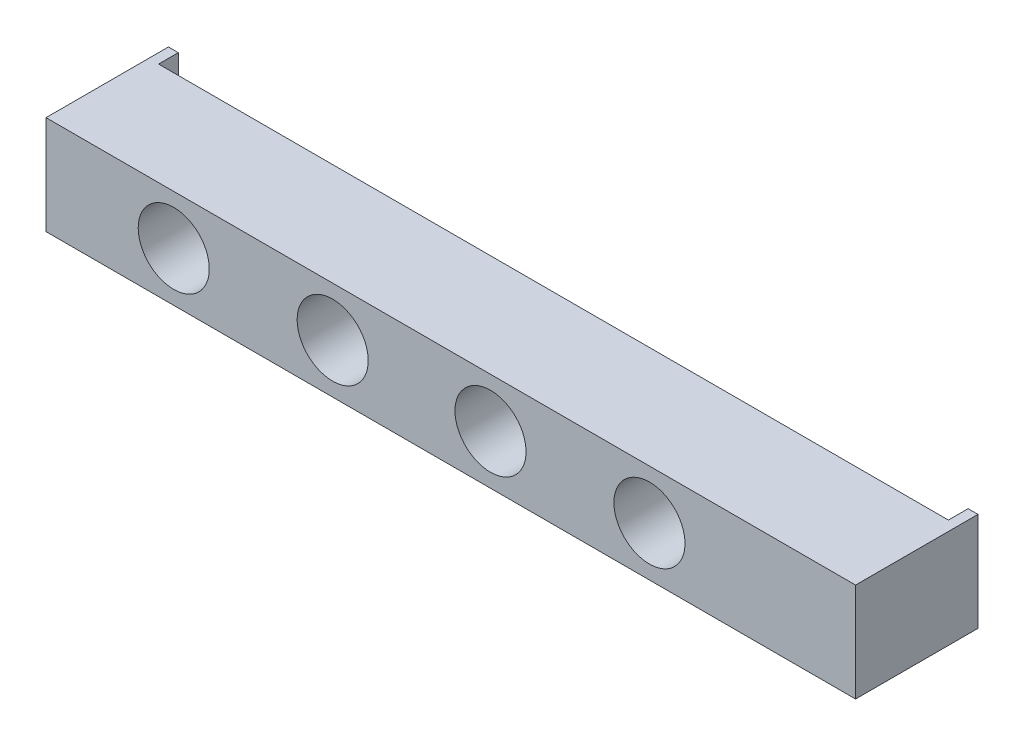
ISO-10303-21;
HEADER;
FILE_DESCRIPTION(('STEP AP214'),'2;1');
FILE_NAME('part.step','',(''),(''),'','','');
FILE_SCHEMA(('AUTOMOTIVE_DESIGN { 1 0 10303 214 1 1 1 1 }'));
ENDSEC;
DATA;
#1=APPLICATION_CONTEXT('core data for automotive mechanical design processes');
#2=APPLICATION_PROTOCOL_DEFINITION('international standard','automotive_design',2000,#1);
#3=PRODUCT_CONTEXT('',#1,'mechanical');
#4=PRODUCT('Part','Part','',(#3));
#5=PRODUCT_RELATED_PRODUCT_CATEGORY('part','',(#4));
#6=PRODUCT_DEFINITION_FORMATION('','',#4);
#7=PRODUCT_DEFINITION_CONTEXT('part definition',#1,'design');
#8=PRODUCT_DEFINITION('design','',#6,#7);
#9=PRODUCT_DEFINITION_SHAPE('','',#8);
#10=(LENGTH_UNIT() NAMED_UNIT(*) SI_UNIT(.MILLI.,.METRE.));
#11=(NAMED_UNIT(*) PLANE_ANGLE_UNIT() SI_UNIT($,.RADIAN.));
#12=(NAMED_UNIT(*) SI_UNIT($,.STERADIAN.) SOLID_ANGLE_UNIT());
#13=UNCERTAINTY_MEASURE_WITH_UNIT(LENGTH_MEASURE(1.E-05),#10,'distance_accuracy_value','');
#14=(GEOMETRIC_REPRESENTATION_CONTEXT(3) GLOBAL_UNCERTAINTY_ASSIGNED_CONTEXT((#13)) GLOBAL_UNIT_ASSIGNED_CONTEXT((#10,
#11,#12)) REPRESENTATION_CONTEXT('',''));
#15=CARTESIAN_POINT('',(0.,0.,0.));
#16=DIRECTION('',(0.,0.,1.));
#17=DIRECTION('',(1.,0.,0.));
#18=AXIS2_PLACEMENT_3D('',#15,#16,#17);
#19=CARTESIAN_POINT('',(0.,0.,0.));
#20=DIRECTION('',(0.,0.,-1.));
#21=DIRECTION('',(-1.,0.,0.));
#22=AXIS2_PLACEMENT_3D('',#19,#20,#21);
#23=PLANE('',#22);
#24=CARTESIAN_POINT('',(32.3443244123659,12.5,0.));
#25=DIRECTION('',(0.,0.,-1.));
#26=DIRECTION('',(-1.,0.,0.));
#27=AXIS2_PLACEMENT_3D('',#24,#25,#26);
#28=CIRCLE('',#27,8.99999999999999);
#29=CARTESIAN_POINT('',(23.3443244123659,12.5,0.));
#30=VERTEX_POINT('',#29);
#31=EDGE_CURVE('E341',#30,#30,#28,.T.);
#32=ORIENTED_EDGE('',*,*,#31,.F.);
#33=EDGE_LOOP('',(#32));
#34=FACE_BOUND('',#33,.T.);
#35=CARTESIAN_POINT('',(72.5886654471327,12.5,0.));
#36=DIRECTION('',(0.,0.,-1.));
#37=DIRECTION('',(-1.,0.,0.));
#38=AXIS2_PLACEMENT_3D('',#35,#36,#37);
#39=CIRCLE('',#38,8.99999999999999);
#40=CARTESIAN_POINT('',(63.5886654471327,12.5,0.));
#41=VERTEX_POINT('',#40);
#42=EDGE_CURVE('E343',#41,#41,#39,.T.);
#43=ORIENTED_EDGE('',*,*,#42,.F.);
#44=EDGE_LOOP('',(#43));
#45=FACE_BOUND('',#44,.T.);
#46=CARTESIAN_POINT('',(112.561085258692,12.5,0.));
#47=DIRECTION('',(0.,0.,-1.));
#48=DIRECTION('',(-1.,0.,0.));
#49=AXIS2_PLACEMENT_3D('',#46,#47,#48);
#50=CIRCLE('',#49,8.99999999999999);
#51=CARTESIAN_POINT('',(103.561085258692,12.5,0.));
#52=VERTEX_POINT('',#51);
#53=EDGE_CURVE('E351',#52,#52,#50,.T.);
#54=ORIENTED_EDGE('',*,*,#53,.F.);
#55=EDGE_LOOP('',(#54));
#56=FACE_BOUND('',#55,.T.);
#57=CARTESIAN_POINT('',(152.805426293458,12.5,0.));
#58=DIRECTION('',(0.,0.,-1.));
#59=DIRECTION('',(-1.,0.,0.));
#60=AXIS2_PLACEMENT_3D('',#57,#58,#59);
#61=CIRCLE('',#60,8.99999999999998);
#62=CARTESIAN_POINT('',(143.805426293458,12.5,0.));
#63=VERTEX_POINT('',#62);
#64=EDGE_CURVE('E356',#63,#63,#61,.T.);
#65=ORIENTED_EDGE('',*,*,#64,.F.);
#66=EDGE_LOOP('',(#65));
#67=FACE_BOUND('',#66,.T.);
#68=DIRECTION('',(-1.,0.,0.));
#69=VECTOR('',#68,1.);
#70=CARTESIAN_POINT('',(0.,25.,0.));
#71=LINE('',#70,#69);
#72=CARTESIAN_POINT('',(202.5,25.,0.));
#73=VERTEX_POINT('',#72);
#74=CARTESIAN_POINT('',(2.5,25.,0.));
#75=VERTEX_POINT('',#74);
#76=EDGE_CURVE('E66',#73,#75,#71,.T.);
#77=ORIENTED_EDGE('',*,*,#76,.F.);
#78=DIRECTION('',(0.,1.,0.));
#79=VECTOR('',#78,1.);
#80=CARTESIAN_POINT('',(202.5,25.,0.));
#81=LINE('',#80,#79);
#82=CARTESIAN_POINT('',(202.5,0.,0.));
#83=VERTEX_POINT('',#82);
#84=EDGE_CURVE('E132',#83,#73,#81,.T.);
#85=ORIENTED_EDGE('',*,*,#84,.F.);
#86=DIRECTION('',(1.,0.,0.));
#87=VECTOR('',#86,1.);
#88=CARTESIAN_POINT('',(0.,0.,0.));
#89=LINE('',#88,#87);
#90=CARTESIAN_POINT('',(2.5,0.,0.));
#91=VERTEX_POINT('',#90);
#92=EDGE_CURVE('E162',#91,#83,#89,.T.);
#93=ORIENTED_EDGE('',*,*,#92,.F.);
#94=DIRECTION('',(0.,-1.,0.));
#95=VECTOR('',#94,1.);
#96=CARTESIAN_POINT('',(2.5,25.,0.));
#97=LINE('',#96,#95);
#98=EDGE_CURVE('E143',#75,#91,#97,.T.);
#99=ORIENTED_EDGE('',*,*,#98,.F.);
#100=EDGE_LOOP('',(#77,#85,#93,#99));
#101=FACE_BOUND('',#100,.T.);
#102=ADVANCED_FACE('F46',(#34,#45,#56,#67,#101),#23,.T.);
#103=CARTESIAN_POINT('',(0.,0.,26.));
#104=DIRECTION('',(1.,0.,0.));
#105=DIRECTION('',(0.,0.,-1.));
#106=AXIS2_PLACEMENT_3D('',#103,#104,#105);
#107=PLANE('',#106);
#108=DIRECTION('',(0.,0.,-1.));
#109=VECTOR('',#108,1.);
#110=CARTESIAN_POINT('',(0.,25.,26.));
#111=LINE('',#110,#109);
#112=CARTESIAN_POINT('',(0.,25.,26.));
#113=VERTEX_POINT('',#112);
#114=CARTESIAN_POINT('',(0.,25.,-5.));
#115=VERTEX_POINT('',#114);
#116=EDGE_CURVE('E171',#113,#115,#111,.T.);
#117=ORIENTED_EDGE('',*,*,#116,.T.);
#118=DIRECTION('',(0.,1.,0.));
#119=VECTOR('',#118,1.);
#120=CARTESIAN_POINT('',(0.,25.,-5.));
#121=LINE('',#120,#119);
#122=CARTESIAN_POINT('',(0.,0.,-5.));
#123=VERTEX_POINT('',#122);
#124=EDGE_CURVE('E144',#123,#115,#121,.T.);
#125=ORIENTED_EDGE('',*,*,#124,.F.);
#126=DIRECTION('',(0.,0.,-1.));
#127=VECTOR('',#126,1.);
#128=CARTESIAN_POINT('',(0.,0.,26.));
#129=LINE('',#128,#127);
#130=CARTESIAN_POINT('',(0.,0.,26.));
#131=VERTEX_POINT('',#130);
#132=EDGE_CURVE('E13',#131,#123,#129,.T.);
#133=ORIENTED_EDGE('',*,*,#132,.F.);
#134=DIRECTION('',(0.,-1.,0.));
#135=VECTOR('',#134,1.);
#136=CARTESIAN_POINT('',(0.,0.,26.));
#137=LINE('',#136,#135);
#138=EDGE_CURVE('E163',#113,#131,#137,.T.);
#139=ORIENTED_EDGE('',*,*,#138,.F.);
#140=EDGE_LOOP('',(#117,#125,#133,#139));
#141=FACE_BOUND('',#140,.T.);
#142=ADVANCED_FACE('F48',(#141),#107,.F.);
#143=CARTESIAN_POINT('',(0.,0.,26.));
#144=DIRECTION('',(0.,1.,0.));
#145=DIRECTION('',(0.,0.,1.));
#146=AXIS2_PLACEMENT_3D('',#143,#144,#145);
#147=PLANE('',#146);
#148=ORIENTED_EDGE('',*,*,#132,.T.);
#149=DIRECTION('',(-1.,0.,0.));
#150=VECTOR('',#149,1.);
#151=CARTESIAN_POINT('',(0.,0.,-5.));
#152=LINE('',#151,#150);
#153=CARTESIAN_POINT('',(2.5,0.,-5.));
#154=VERTEX_POINT('',#153);
#155=EDGE_CURVE('E151',#154,#123,#152,.T.);
#156=ORIENTED_EDGE('',*,*,#155,.F.);
#157=DIRECTION('',(0.,0.,1.));
#158=VECTOR('',#157,1.);
#159=CARTESIAN_POINT('',(2.5,0.,-5.));
#160=LINE('',#159,#158);
#161=EDGE_CURVE('E154',#154,#91,#160,.T.);
#162=ORIENTED_EDGE('',*,*,#161,.T.);
#163=ORIENTED_EDGE('',*,*,#92,.T.);
#164=DIRECTION('',(0.,0.,1.));
#165=VECTOR('',#164,1.);
#166=CARTESIAN_POINT('',(202.5,0.,-5.));
#167=LINE('',#166,#165);
#168=CARTESIAN_POINT('',(202.5,0.,-5.));
#169=VERTEX_POINT('',#168);
#170=EDGE_CURVE('E124',#169,#83,#167,.T.);
#171=ORIENTED_EDGE('',*,*,#170,.F.);
#172=DIRECTION('',(-1.,0.,0.));
#173=VECTOR('',#172,1.);
#174=CARTESIAN_POINT('',(205.,0.,-5.));
#175=LINE('',#174,#173);
#176=CARTESIAN_POINT('',(205.,0.,-5.));
#177=VERTEX_POINT('',#176);
#178=EDGE_CURVE('E121',#177,#169,#175,.T.);
#179=ORIENTED_EDGE('',*,*,#178,.F.);
#180=DIRECTION('',(0.,0.,-1.));
#181=VECTOR('',#180,1.);
#182=CARTESIAN_POINT('',(205.,0.,26.));
#183=LINE('',#182,#181);
#184=CARTESIAN_POINT('',(205.,0.,26.));
#185=VERTEX_POINT('',#184);
#186=EDGE_CURVE('E54',#185,#177,#183,.T.);
#187=ORIENTED_EDGE('',*,*,#186,.F.);
#188=DIRECTION('',(1.,0.,0.));
#189=VECTOR('',#188,1.);
#190=CARTESIAN_POINT('',(0.,0.,26.));
#191=LINE('',#190,#189);
#192=EDGE_CURVE('E166',#131,#185,#191,.T.);
#193=ORIENTED_EDGE('',*,*,#192,.F.);
#194=EDGE_LOOP('',(#148,#156,#162,#163,#171,#179,#187,#193));
#195=FACE_BOUND('',#194,.T.);
#196=ADVANCED_FACE('F122',(#195),#147,.F.);
#197=CARTESIAN_POINT('',(205.,0.,26.));
#198=DIRECTION('',(-1.,0.,0.));
#199=DIRECTION('',(0.,0.,1.));
#200=AXIS2_PLACEMENT_3D('',#197,#198,#199);
#201=PLANE('',#200);
#202=ORIENTED_EDGE('',*,*,#186,.T.);
#203=DIRECTION('',(0.,-1.,0.));
#204=VECTOR('',#203,1.);
#205=CARTESIAN_POINT('',(205.,25.,-5.));
#206=LINE('',#205,#204);
#207=CARTESIAN_POINT('',(205.,25.,-5.));
#208=VERTEX_POINT('',#207);
#209=EDGE_CURVE('E116',#208,#177,#206,.T.);
#210=ORIENTED_EDGE('',*,*,#209,.F.);
#211=DIRECTION('',(0.,0.,-1.));
#212=VECTOR('',#211,1.);
#213=CARTESIAN_POINT('',(205.,25.,26.));
#214=LINE('',#213,#212);
#215=CARTESIAN_POINT('',(205.,25.,26.));
#216=VERTEX_POINT('',#215);
#217=EDGE_CURVE('E119',#216,#208,#214,.T.);
#218=ORIENTED_EDGE('',*,*,#217,.F.);
#219=DIRECTION('',(0.,1.,0.));
#220=VECTOR('',#219,1.);
#221=CARTESIAN_POINT('',(205.,0.,26.));
#222=LINE('',#221,#220);
#223=EDGE_CURVE('E117',#185,#216,#222,.T.);
#224=ORIENTED_EDGE('',*,*,#223,.F.);
#225=EDGE_LOOP('',(#202,#210,#218,#224));
#226=FACE_BOUND('',#225,.T.);
#227=ADVANCED_FACE('F113',(#226),#201,.F.);
#228=CARTESIAN_POINT('',(0.,25.,26.));
#229=DIRECTION('',(0.,-1.,0.));
#230=DIRECTION('',(0.,0.,-1.));
#231=AXIS2_PLACEMENT_3D('',#228,#229,#230);
#232=PLANE('',#231);
#233=ORIENTED_EDGE('',*,*,#217,.T.);
#234=DIRECTION('',(1.,0.,0.));
#235=VECTOR('',#234,1.);
#236=CARTESIAN_POINT('',(205.,25.,-5.));
#237=LINE('',#236,#235);
#238=CARTESIAN_POINT('',(202.5,25.,-5.));
#239=VERTEX_POINT('',#238);
#240=EDGE_CURVE('E131',#239,#208,#237,.T.);
#241=ORIENTED_EDGE('',*,*,#240,.F.);
#242=DIRECTION('',(0.,0.,1.));
#243=VECTOR('',#242,1.);
#244=CARTESIAN_POINT('',(202.5,25.,-5.));
#245=LINE('',#244,#243);
#246=EDGE_CURVE('E61',#239,#73,#245,.T.);
#247=ORIENTED_EDGE('',*,*,#246,.T.);
#248=ORIENTED_EDGE('',*,*,#76,.T.);
#249=DIRECTION('',(0.,0.,1.));
#250=VECTOR('',#249,1.);
#251=CARTESIAN_POINT('',(2.5,25.,-5.));
#252=LINE('',#251,#250);
#253=CARTESIAN_POINT('',(2.5,25.,-5.));
#254=VERTEX_POINT('',#253);
#255=EDGE_CURVE('E159',#254,#75,#252,.T.);
#256=ORIENTED_EDGE('',*,*,#255,.F.);
#257=DIRECTION('',(1.,0.,0.));
#258=VECTOR('',#257,1.);
#259=CARTESIAN_POINT('',(0.,25.,-5.));
#260=LINE('',#259,#258);
#261=EDGE_CURVE('E147',#115,#254,#260,.T.);
#262=ORIENTED_EDGE('',*,*,#261,.F.);
#263=ORIENTED_EDGE('',*,*,#116,.F.);
#264=DIRECTION('',(-1.,0.,0.));
#265=VECTOR('',#264,1.);
#266=CARTESIAN_POINT('',(0.,25.,26.));
#267=LINE('',#266,#265);
#268=EDGE_CURVE('E169',#216,#113,#267,.T.);
#269=ORIENTED_EDGE('',*,*,#268,.F.);
#270=EDGE_LOOP('',(#233,#241,#247,#248,#256,#262,#263,#269));
#271=FACE_BOUND('',#270,.T.);
#272=ADVANCED_FACE('F176',(#271),#232,.F.);
#273=CARTESIAN_POINT('',(0.,0.,26.));
#274=DIRECTION('',(0.,0.,-1.));
#275=DIRECTION('',(-1.,0.,0.));
#276=AXIS2_PLACEMENT_3D('',#273,#274,#275);
#277=PLANE('',#276);
#278=CARTESIAN_POINT('',(32.3443244123659,12.5,26.));
#279=DIRECTION('',(0.,0.,-1.));
#280=DIRECTION('',(-1.,0.,0.));
#281=AXIS2_PLACEMENT_3D('',#278,#279,#280);
#282=CIRCLE('',#281,8.99999999999999);
#283=CARTESIAN_POINT('',(23.3443244123659,12.5,26.));
#284=VERTEX_POINT('',#283);
#285=EDGE_CURVE('E339',#284,#284,#282,.T.);
#286=ORIENTED_EDGE('',*,*,#285,.T.);
#287=EDGE_LOOP('',(#286));
#288=FACE_BOUND('',#287,.T.);
#289=CARTESIAN_POINT('',(72.5886654471327,12.5,26.));
#290=DIRECTION('',(0.,0.,-1.));
#291=DIRECTION('',(-1.,0.,0.));
#292=AXIS2_PLACEMENT_3D('',#289,#290,#291);
#293=CIRCLE('',#292,8.99999999999998);
#294=CARTESIAN_POINT('',(63.5886654471327,12.5,26.));
#295=VERTEX_POINT('',#294);
#296=EDGE_CURVE('E348',#295,#295,#293,.T.);
#297=ORIENTED_EDGE('',*,*,#296,.T.);
#298=EDGE_LOOP('',(#297));
#299=FACE_BOUND('',#298,.T.);
#300=CARTESIAN_POINT('',(112.561085258692,12.5,26.));
#301=DIRECTION('',(0.,0.,-1.));
#302=DIRECTION('',(-1.,0.,0.));
#303=AXIS2_PLACEMENT_3D('',#300,#301,#302);
#304=CIRCLE('',#303,8.99999999999998);
#305=CARTESIAN_POINT('',(103.561085258692,12.5,26.));
#306=VERTEX_POINT('',#305);
#307=EDGE_CURVE('E354',#306,#306,#304,.T.);
#308=ORIENTED_EDGE('',*,*,#307,.T.);
#309=EDGE_LOOP('',(#308));
#310=FACE_BOUND('',#309,.T.);
#311=CARTESIAN_POINT('',(152.805426293458,12.5,26.));
#312=DIRECTION('',(0.,0.,-1.));
#313=DIRECTION('',(-1.,0.,0.));
#314=AXIS2_PLACEMENT_3D('',#311,#312,#313);
#315=CIRCLE('',#314,8.99999999999998);
#316=CARTESIAN_POINT('',(143.805426293458,12.5,26.));
#317=VERTEX_POINT('',#316);
#318=EDGE_CURVE('E134',#317,#317,#315,.T.);
#319=ORIENTED_EDGE('',*,*,#318,.T.);
#320=EDGE_LOOP('',(#319));
#321=FACE_BOUND('',#320,.T.);
#322=ORIENTED_EDGE('',*,*,#138,.T.);
#323=ORIENTED_EDGE('',*,*,#192,.T.);
#324=ORIENTED_EDGE('',*,*,#223,.T.);
#325=ORIENTED_EDGE('',*,*,#268,.T.);
#326=EDGE_LOOP('',(#322,#323,#324,#325));
#327=FACE_BOUND('',#326,.T.);
#328=ADVANCED_FACE('F181',(#288,#299,#310,#321,#327),#277,.F.);
#329=CARTESIAN_POINT('',(2.5,25.,-5.));
#330=DIRECTION('',(-1.,0.,0.));
#331=DIRECTION('',(0.,-1.,0.));
#332=AXIS2_PLACEMENT_3D('',#329,#330,#331);
#333=PLANE('',#332);
#334=ORIENTED_EDGE('',*,*,#98,.T.);
#335=ORIENTED_EDGE('',*,*,#161,.F.);
#336=DIRECTION('',(0.,-1.,0.));
#337=VECTOR('',#336,1.);
#338=CARTESIAN_POINT('',(2.5,25.,-5.));
#339=LINE('',#338,#337);
#340=EDGE_CURVE('E149',#254,#154,#339,.T.);
#341=ORIENTED_EDGE('',*,*,#340,.F.);
#342=ORIENTED_EDGE('',*,*,#255,.T.);
#343=EDGE_LOOP('',(#334,#335,#341,#342));
#344=FACE_BOUND('',#343,.T.);
#345=ADVANCED_FACE('F191',(#344),#333,.F.);
#346=CARTESIAN_POINT('',(0.,0.,-5.));
#347=DIRECTION('',(0.,0.,1.));
#348=DIRECTION('',(1.,0.,0.));
#349=AXIS2_PLACEMENT_3D('',#346,#347,#348);
#350=PLANE('',#349);
#351=ORIENTED_EDGE('',*,*,#124,.T.);
#352=ORIENTED_EDGE('',*,*,#261,.T.);
#353=ORIENTED_EDGE('',*,*,#340,.T.);
#354=ORIENTED_EDGE('',*,*,#155,.T.);
#355=EDGE_LOOP('',(#351,#352,#353,#354));
#356=FACE_BOUND('',#355,.T.);
#357=ADVANCED_FACE('F187',(#356),#350,.F.);
#358=CARTESIAN_POINT('',(202.5,25.,-5.));
#359=DIRECTION('',(1.,0.,0.));
#360=DIRECTION('',(0.,0.,-1.));
#361=AXIS2_PLACEMENT_3D('',#358,#359,#360);
#362=PLANE('',#361);
#363=ORIENTED_EDGE('',*,*,#84,.T.);
#364=ORIENTED_EDGE('',*,*,#246,.F.);
#365=DIRECTION('',(0.,1.,0.));
#366=VECTOR('',#365,1.);
#367=CARTESIAN_POINT('',(202.5,25.,-5.));
#368=LINE('',#367,#366);
#369=EDGE_CURVE('E127',#169,#239,#368,.T.);
#370=ORIENTED_EDGE('',*,*,#369,.F.);
#371=ORIENTED_EDGE('',*,*,#170,.T.);
#372=EDGE_LOOP('',(#363,#364,#370,#371));
#373=FACE_BOUND('',#372,.T.);
#374=ADVANCED_FACE('F195',(#373),#362,.F.);
#375=CARTESIAN_POINT('',(0.,0.,-5.));
#376=DIRECTION('',(0.,0.,-1.));
#377=DIRECTION('',(-1.,0.,0.));
#378=AXIS2_PLACEMENT_3D('',#375,#376,#377);
#379=PLANE('',#378);
#380=ORIENTED_EDGE('',*,*,#209,.T.);
#381=ORIENTED_EDGE('',*,*,#178,.T.);
#382=ORIENTED_EDGE('',*,*,#369,.T.);
#383=ORIENTED_EDGE('',*,*,#240,.T.);
#384=EDGE_LOOP('',(#380,#381,#382,#383));
#385=FACE_BOUND('',#384,.T.);
#386=ADVANCED_FACE('F130',(#385),#379,.T.);
#387=CARTESIAN_POINT('',(152.805426293458,12.5,0.));
#388=DIRECTION('',(0.,0.,-1.));
#389=DIRECTION('',(-1.,0.,0.));
#390=AXIS2_PLACEMENT_3D('',#387,#388,#389);
#391=CYLINDRICAL_SURFACE('',#390,8.99999999999998);
#392=ORIENTED_EDGE('',*,*,#318,.F.);
#393=EDGE_LOOP('',(#392));
#394=FACE_BOUND('',#393,.T.);
#395=ORIENTED_EDGE('',*,*,#64,.T.);
#396=EDGE_LOOP('',(#395));
#397=FACE_BOUND('',#396,.T.);
#398=ADVANCED_FACE('F202',(#394,#397),#391,.F.);
#399=CARTESIAN_POINT('',(112.561085258692,12.5,0.));
#400=DIRECTION('',(0.,0.,-1.));
#401=DIRECTION('',(-1.,0.,0.));
#402=AXIS2_PLACEMENT_3D('',#399,#400,#401);
#403=CYLINDRICAL_SURFACE('',#402,8.99999999999999);
#404=ORIENTED_EDGE('',*,*,#307,.F.);
#405=EDGE_LOOP('',(#404));
#406=FACE_BOUND('',#405,.T.);
#407=ORIENTED_EDGE('',*,*,#53,.T.);
#408=EDGE_LOOP('',(#407));
#409=FACE_BOUND('',#408,.T.);
#410=ADVANCED_FACE('F302',(#406,#409),#403,.F.);
#411=CARTESIAN_POINT('',(72.5886654471327,12.5,0.));
#412=DIRECTION('',(0.,0.,-1.));
#413=DIRECTION('',(-1.,0.,0.));
#414=AXIS2_PLACEMENT_3D('',#411,#412,#413);
#415=CYLINDRICAL_SURFACE('',#414,8.99999999999999);
#416=ORIENTED_EDGE('',*,*,#296,.F.);
#417=EDGE_LOOP('',(#416));
#418=FACE_BOUND('',#417,.T.);
#419=ORIENTED_EDGE('',*,*,#42,.T.);
#420=EDGE_LOOP('',(#419));
#421=FACE_BOUND('',#420,.T.);
#422=ADVANCED_FACE('F309',(#418,#421),#415,.F.);
#423=CARTESIAN_POINT('',(32.3443244123659,12.5,0.));
#424=DIRECTION('',(0.,0.,-1.));
#425=DIRECTION('',(-1.,0.,0.));
#426=AXIS2_PLACEMENT_3D('',#423,#424,#425);
#427=CYLINDRICAL_SURFACE('',#426,8.99999999999999);
#428=ORIENTED_EDGE('',*,*,#285,.F.);
#429=EDGE_LOOP('',(#428));
#430=FACE_BOUND('',#429,.T.);
#431=ORIENTED_EDGE('',*,*,#31,.T.);
#432=EDGE_LOOP('',(#431));
#433=FACE_BOUND('',#432,.T.);
#434=ADVANCED_FACE('F317',(#430,#433),#427,.F.);
#435=CLOSED_SHELL('',(#102,#142,#196,#227,#272,#328,#345,#357,#374,#386,#398,#410,#422,#434));
#436=MANIFOLD_SOLID_BREP('B2',#435);
#437=ADVANCED_BREP_SHAPE_REPRESENTATION('',(#18,#436),#14);
#438=SHAPE_DEFINITION_REPRESENTATION(#9,#437);
ENDSEC;
END-ISO-10303-21;
